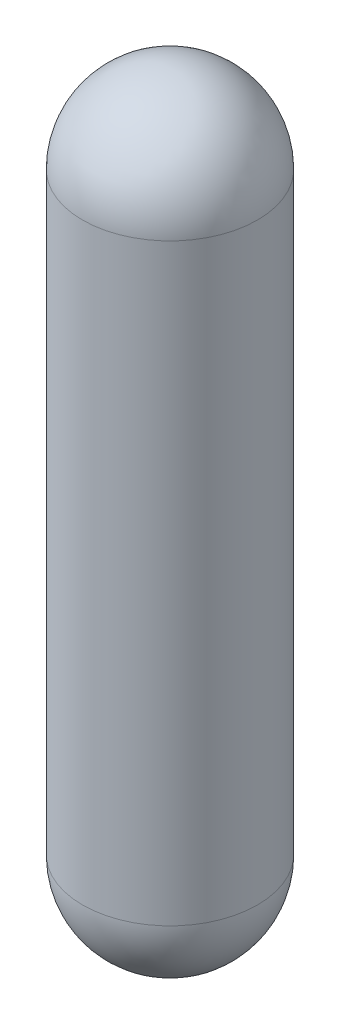
ISO-10303-21;
HEADER;
FILE_DESCRIPTION(('STEP AP214'),'2;1');
FILE_NAME('part.step','',(''),(''),'','','');
FILE_SCHEMA(('AUTOMOTIVE_DESIGN { 1 0 10303 214 1 1 1 1 }'));
ENDSEC;
DATA;
#1=APPLICATION_CONTEXT('core data for automotive mechanical design processes');
#2=APPLICATION_PROTOCOL_DEFINITION('international standard','automotive_design',2000,#1);
#3=PRODUCT_CONTEXT('',#1,'mechanical');
#4=PRODUCT('Part','Part','',(#3));
#5=PRODUCT_RELATED_PRODUCT_CATEGORY('part','',(#4));
#6=PRODUCT_DEFINITION_FORMATION('','',#4);
#7=PRODUCT_DEFINITION_CONTEXT('part definition',#1,'design');
#8=PRODUCT_DEFINITION('design','',#6,#7);
#9=PRODUCT_DEFINITION_SHAPE('','',#8);
#10=(LENGTH_UNIT() NAMED_UNIT(*) SI_UNIT(.MILLI.,.METRE.));
#11=(NAMED_UNIT(*) PLANE_ANGLE_UNIT() SI_UNIT($,.RADIAN.));
#12=(NAMED_UNIT(*) SI_UNIT($,.STERADIAN.) SOLID_ANGLE_UNIT());
#13=UNCERTAINTY_MEASURE_WITH_UNIT(LENGTH_MEASURE(1.E-05),#10,'distance_accuracy_value','');
#14=(GEOMETRIC_REPRESENTATION_CONTEXT(3) GLOBAL_UNCERTAINTY_ASSIGNED_CONTEXT((#13)) GLOBAL_UNIT_ASSIGNED_CONTEXT((#10,
#11,#12)) REPRESENTATION_CONTEXT('',''));
#15=CARTESIAN_POINT('',(0.,0.,0.));
#16=DIRECTION('',(0.,0.,1.));
#17=DIRECTION('',(1.,0.,0.));
#18=AXIS2_PLACEMENT_3D('',#15,#16,#17);
#19=CARTESIAN_POINT('',(0.,-43.5,0.));
#20=DIRECTION('',(0.,1.,0.));
#21=DIRECTION('',(-1.,0.,0.));
#22=AXIS2_PLACEMENT_3D('',#19,#20,#21);
#23=SPHERICAL_SURFACE('',#22,12.8333333333333);
#24=CARTESIAN_POINT('',(0.,-43.5,0.));
#25=DIRECTION('',(0.,1.,0.));
#26=DIRECTION('',(-1.,0.,0.));
#27=AXIS2_PLACEMENT_3D('',#24,#25,#26);
#28=CIRCLE('',#27,12.8333333333333);
#29=CARTESIAN_POINT('',(-12.8333333333333,-43.5,0.));
#30=VERTEX_POINT('',#29);
#31=EDGE_CURVE('E10',#30,#30,#28,.T.);
#32=ORIENTED_EDGE('',*,*,#31,.F.);
#33=EDGE_LOOP('',(#32));
#34=FACE_BOUND('',#33,.T.);
#35=ADVANCED_FACE('F43',(#34),#23,.T.);
#36=CARTESIAN_POINT('',(0.,43.5,0.));
#37=DIRECTION('',(0.,1.,0.));
#38=DIRECTION('',(-1.,0.,0.));
#39=AXIS2_PLACEMENT_3D('',#36,#37,#38);
#40=CYLINDRICAL_SURFACE('',#39,12.8333333333333);
#41=CARTESIAN_POINT('',(0.,43.5,0.));
#42=DIRECTION('',(0.,1.,0.));
#43=DIRECTION('',(-1.,0.,0.));
#44=AXIS2_PLACEMENT_3D('',#41,#42,#43);
#45=CIRCLE('',#44,12.8333333333333);
#46=CARTESIAN_POINT('',(-12.8333333333333,43.5,0.));
#47=VERTEX_POINT('',#46);
#48=EDGE_CURVE('E49',#47,#47,#45,.T.);
#49=ORIENTED_EDGE('',*,*,#48,.F.);
#50=EDGE_LOOP('',(#49));
#51=FACE_BOUND('',#50,.T.);
#52=ORIENTED_EDGE('',*,*,#31,.T.);
#53=EDGE_LOOP('',(#52));
#54=FACE_BOUND('',#53,.T.);
#55=ADVANCED_FACE('F56',(#51,#54),#40,.T.);
#56=CARTESIAN_POINT('',(0.,43.5,0.));
#57=DIRECTION('',(0.,1.,0.));
#58=DIRECTION('',(1.,0.,0.));
#59=AXIS2_PLACEMENT_3D('',#56,#57,#58);
#60=SPHERICAL_SURFACE('',#59,12.8333333333333);
#61=ORIENTED_EDGE('',*,*,#48,.T.);
#62=EDGE_LOOP('',(#61));
#63=FACE_BOUND('',#62,.T.);
#64=ADVANCED_FACE('F60',(#63),#60,.T.);
#65=CLOSED_SHELL('',(#35,#55,#64));
#66=MANIFOLD_SOLID_BREP('B2',#65);
#67=ADVANCED_BREP_SHAPE_REPRESENTATION('',(#18,#66),#14);
#68=SHAPE_DEFINITION_REPRESENTATION(#9,#67);
ENDSEC;
END-ISO-10303-21;
